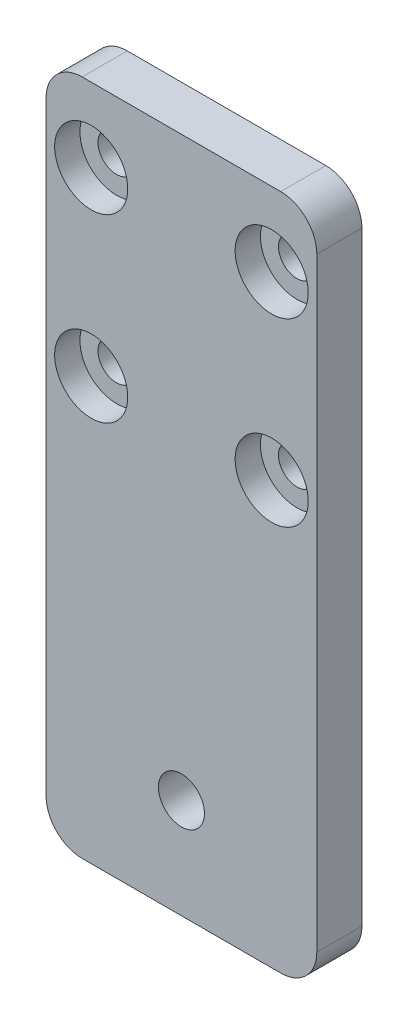
ISO-10303-21;
HEADER;
FILE_DESCRIPTION(('STEP AP214'),'2;1');
FILE_NAME('part.step','',(''),(''),'','','');
FILE_SCHEMA(('AUTOMOTIVE_DESIGN { 1 0 10303 214 1 1 1 1 }'));
ENDSEC;
DATA;
#1=APPLICATION_CONTEXT('core data for automotive mechanical design processes');
#2=APPLICATION_PROTOCOL_DEFINITION('international standard','automotive_design',2000,#1);
#3=PRODUCT_CONTEXT('',#1,'mechanical');
#4=PRODUCT('Part','Part','',(#3));
#5=PRODUCT_RELATED_PRODUCT_CATEGORY('part','',(#4));
#6=PRODUCT_DEFINITION_FORMATION('','',#4);
#7=PRODUCT_DEFINITION_CONTEXT('part definition',#1,'design');
#8=PRODUCT_DEFINITION('design','',#6,#7);
#9=PRODUCT_DEFINITION_SHAPE('','',#8);
#10=(LENGTH_UNIT() NAMED_UNIT(*) SI_UNIT(.MILLI.,.METRE.));
#11=(NAMED_UNIT(*) PLANE_ANGLE_UNIT() SI_UNIT($,.RADIAN.));
#12=(NAMED_UNIT(*) SI_UNIT($,.STERADIAN.) SOLID_ANGLE_UNIT());
#13=UNCERTAINTY_MEASURE_WITH_UNIT(LENGTH_MEASURE(1.E-05),#10,'distance_accuracy_value','');
#14=(GEOMETRIC_REPRESENTATION_CONTEXT(3) GLOBAL_UNCERTAINTY_ASSIGNED_CONTEXT((#13)) GLOBAL_UNIT_ASSIGNED_CONTEXT((#10,
#11,#12)) REPRESENTATION_CONTEXT('',''));
#15=CARTESIAN_POINT('',(0.,0.,0.));
#16=DIRECTION('',(0.,0.,1.));
#17=DIRECTION('',(1.,0.,0.));
#18=AXIS2_PLACEMENT_3D('',#15,#16,#17);
#19=CARTESIAN_POINT('',(25.,66.8,5.));
#20=DIRECTION('',(0.,0.,-1.));
#21=DIRECTION('',(-1.,0.,0.));
#22=AXIS2_PLACEMENT_3D('',#19,#20,#21);
#23=CYLINDRICAL_SURFACE('',#22,2.05);
#24=CARTESIAN_POINT('',(25.,66.8,0.));
#25=DIRECTION('',(0.,0.,1.));
#26=DIRECTION('',(1.,0.,0.));
#27=AXIS2_PLACEMENT_3D('',#24,#25,#26);
#28=CIRCLE('',#27,2.05);
#29=CARTESIAN_POINT('',(27.05,66.8,0.));
#30=VERTEX_POINT('',#29);
#31=EDGE_CURVE('E206',#30,#30,#28,.T.);
#32=ORIENTED_EDGE('',*,*,#31,.F.);
#33=EDGE_LOOP('',(#32));
#34=FACE_BOUND('',#33,.T.);
#35=CARTESIAN_POINT('',(25.,66.8,2.2));
#36=DIRECTION('',(0.,0.,1.));
#37=DIRECTION('',(1.,0.,0.));
#38=AXIS2_PLACEMENT_3D('',#35,#36,#37);
#39=CIRCLE('',#38,2.05);
#40=CARTESIAN_POINT('',(27.05,66.8,2.2));
#41=VERTEX_POINT('',#40);
#42=EDGE_CURVE('E36',#41,#41,#39,.T.);
#43=ORIENTED_EDGE('',*,*,#42,.T.);
#44=EDGE_LOOP('',(#43));
#45=FACE_BOUND('',#44,.T.);
#46=ADVANCED_FACE('F32',(#34,#45),#23,.F.);
#47=CARTESIAN_POINT('',(25.,46.8,5.));
#48=DIRECTION('',(0.,0.,-1.));
#49=DIRECTION('',(-1.,0.,0.));
#50=AXIS2_PLACEMENT_3D('',#47,#48,#49);
#51=CYLINDRICAL_SURFACE('',#50,2.05);
#52=CARTESIAN_POINT('',(25.,46.8,0.));
#53=DIRECTION('',(0.,0.,1.));
#54=DIRECTION('',(1.,0.,0.));
#55=AXIS2_PLACEMENT_3D('',#52,#53,#54);
#56=CIRCLE('',#55,2.05);
#57=CARTESIAN_POINT('',(27.05,46.8,0.));
#58=VERTEX_POINT('',#57);
#59=EDGE_CURVE('E203',#58,#58,#56,.T.);
#60=ORIENTED_EDGE('',*,*,#59,.F.);
#61=EDGE_LOOP('',(#60));
#62=FACE_BOUND('',#61,.T.);
#63=CARTESIAN_POINT('',(25.,46.8,2.2));
#64=DIRECTION('',(0.,0.,1.));
#65=DIRECTION('',(1.,0.,0.));
#66=AXIS2_PLACEMENT_3D('',#63,#64,#65);
#67=CIRCLE('',#66,2.05);
#68=CARTESIAN_POINT('',(27.05,46.8,2.2));
#69=VERTEX_POINT('',#68);
#70=EDGE_CURVE('E170',#69,#69,#67,.T.);
#71=ORIENTED_EDGE('',*,*,#70,.T.);
#72=EDGE_LOOP('',(#71));
#73=FACE_BOUND('',#72,.T.);
#74=ADVANCED_FACE('F245',(#62,#73),#51,.F.);
#75=CARTESIAN_POINT('',(5.,46.8,5.));
#76=DIRECTION('',(0.,0.,-1.));
#77=DIRECTION('',(-1.,0.,0.));
#78=AXIS2_PLACEMENT_3D('',#75,#76,#77);
#79=CYLINDRICAL_SURFACE('',#78,2.05000000000001);
#80=CARTESIAN_POINT('',(5.,46.8,0.));
#81=DIRECTION('',(0.,0.,1.));
#82=DIRECTION('',(1.,0.,0.));
#83=AXIS2_PLACEMENT_3D('',#80,#81,#82);
#84=CIRCLE('',#83,2.05000000000001);
#85=CARTESIAN_POINT('',(7.05,46.8,0.));
#86=VERTEX_POINT('',#85);
#87=EDGE_CURVE('E198',#86,#86,#84,.T.);
#88=ORIENTED_EDGE('',*,*,#87,.F.);
#89=EDGE_LOOP('',(#88));
#90=FACE_BOUND('',#89,.T.);
#91=CARTESIAN_POINT('',(5.,46.8,2.2));
#92=DIRECTION('',(0.,0.,1.));
#93=DIRECTION('',(1.,0.,0.));
#94=AXIS2_PLACEMENT_3D('',#91,#92,#93);
#95=CIRCLE('',#94,2.05000000000001);
#96=CARTESIAN_POINT('',(7.05,46.8,2.2));
#97=VERTEX_POINT('',#96);
#98=EDGE_CURVE('E166',#97,#97,#95,.T.);
#99=ORIENTED_EDGE('',*,*,#98,.T.);
#100=EDGE_LOOP('',(#99));
#101=FACE_BOUND('',#100,.T.);
#102=ADVANCED_FACE('F251',(#90,#101),#79,.F.);
#103=CARTESIAN_POINT('',(5.,66.8,5.));
#104=DIRECTION('',(0.,0.,-1.));
#105=DIRECTION('',(-1.,0.,0.));
#106=AXIS2_PLACEMENT_3D('',#103,#104,#105);
#107=CYLINDRICAL_SURFACE('',#106,2.04999999999999);
#108=CARTESIAN_POINT('',(5.,66.8,0.));
#109=DIRECTION('',(0.,0.,1.));
#110=DIRECTION('',(1.,0.,0.));
#111=AXIS2_PLACEMENT_3D('',#108,#109,#110);
#112=CIRCLE('',#111,2.04999999999999);
#113=CARTESIAN_POINT('',(7.04999999999999,66.8,0.));
#114=VERTEX_POINT('',#113);
#115=EDGE_CURVE('E132',#114,#114,#112,.T.);
#116=ORIENTED_EDGE('',*,*,#115,.F.);
#117=EDGE_LOOP('',(#116));
#118=FACE_BOUND('',#117,.T.);
#119=CARTESIAN_POINT('',(5.,66.8,2.2));
#120=DIRECTION('',(0.,0.,1.));
#121=DIRECTION('',(1.,0.,0.));
#122=AXIS2_PLACEMENT_3D('',#119,#120,#121);
#123=CIRCLE('',#122,2.04999999999999);
#124=CARTESIAN_POINT('',(7.04999999999999,66.8,2.2));
#125=VERTEX_POINT('',#124);
#126=EDGE_CURVE('E161',#125,#125,#123,.T.);
#127=ORIENTED_EDGE('',*,*,#126,.T.);
#128=EDGE_LOOP('',(#127));
#129=FACE_BOUND('',#128,.T.);
#130=ADVANCED_FACE('F258',(#118,#129),#107,.F.);
#131=CARTESIAN_POINT('',(0.,0.,5.));
#132=DIRECTION('',(0.,0.,1.));
#133=DIRECTION('',(1.,0.,0.));
#134=AXIS2_PLACEMENT_3D('',#131,#132,#133);
#135=PLANE('',#134);
#136=CARTESIAN_POINT('',(25.,66.8,5.));
#137=DIRECTION('',(0.,0.,1.));
#138=DIRECTION('',(1.,0.,0.));
#139=AXIS2_PLACEMENT_3D('',#136,#137,#138);
#140=CIRCLE('',#139,4.05);
#141=CARTESIAN_POINT('',(29.05,66.8,5.));
#142=VERTEX_POINT('',#141);
#143=EDGE_CURVE('E186',#142,#142,#140,.T.);
#144=ORIENTED_EDGE('',*,*,#143,.F.);
#145=EDGE_LOOP('',(#144));
#146=FACE_BOUND('',#145,.T.);
#147=CARTESIAN_POINT('',(25.,46.8,5.));
#148=DIRECTION('',(0.,0.,1.));
#149=DIRECTION('',(1.,0.,0.));
#150=AXIS2_PLACEMENT_3D('',#147,#148,#149);
#151=CIRCLE('',#150,4.05);
#152=CARTESIAN_POINT('',(29.05,46.8,5.));
#153=VERTEX_POINT('',#152);
#154=EDGE_CURVE('E179',#153,#153,#151,.T.);
#155=ORIENTED_EDGE('',*,*,#154,.F.);
#156=EDGE_LOOP('',(#155));
#157=FACE_BOUND('',#156,.T.);
#158=CARTESIAN_POINT('',(5.,46.8,5.));
#159=DIRECTION('',(0.,0.,1.));
#160=DIRECTION('',(1.,0.,0.));
#161=AXIS2_PLACEMENT_3D('',#158,#159,#160);
#162=CIRCLE('',#161,4.05);
#163=CARTESIAN_POINT('',(9.05,46.8,5.));
#164=VERTEX_POINT('',#163);
#165=EDGE_CURVE('E172',#164,#164,#162,.T.);
#166=ORIENTED_EDGE('',*,*,#165,.F.);
#167=EDGE_LOOP('',(#166));
#168=FACE_BOUND('',#167,.T.);
#169=CARTESIAN_POINT('',(5.,66.8,5.));
#170=DIRECTION('',(0.,0.,1.));
#171=DIRECTION('',(1.,0.,0.));
#172=AXIS2_PLACEMENT_3D('',#169,#170,#171);
#173=CIRCLE('',#172,4.05);
#174=CARTESIAN_POINT('',(9.05,66.8,5.));
#175=VERTEX_POINT('',#174);
#176=EDGE_CURVE('E168',#175,#175,#173,.T.);
#177=ORIENTED_EDGE('',*,*,#176,.F.);
#178=EDGE_LOOP('',(#177));
#179=FACE_BOUND('',#178,.T.);
#180=DIRECTION('',(0.,-1.,0.));
#181=VECTOR('',#180,1.);
#182=CARTESIAN_POINT('',(0.,75.,5.));
#183=LINE('',#182,#181);
#184=CARTESIAN_POINT('',(0.,71.,5.));
#185=VERTEX_POINT('',#184);
#186=CARTESIAN_POINT('',(0.,4.,5.));
#187=VERTEX_POINT('',#186);
#188=EDGE_CURVE('E137',#185,#187,#183,.T.);
#189=ORIENTED_EDGE('',*,*,#188,.T.);
#190=CARTESIAN_POINT('',(4.,4.,5.));
#191=DIRECTION('',(0.,0.,1.));
#192=DIRECTION('',(1.,0.,0.));
#193=AXIS2_PLACEMENT_3D('',#190,#191,#192);
#194=CIRCLE('',#193,4.);
#195=CARTESIAN_POINT('',(4.,0.,5.));
#196=VERTEX_POINT('',#195);
#197=EDGE_CURVE('E152',#187,#196,#194,.T.);
#198=ORIENTED_EDGE('',*,*,#197,.T.);
#199=DIRECTION('',(1.,0.,0.));
#200=VECTOR('',#199,1.);
#201=CARTESIAN_POINT('',(0.,0.,5.));
#202=LINE('',#201,#200);
#203=CARTESIAN_POINT('',(26.,0.,5.));
#204=VERTEX_POINT('',#203);
#205=EDGE_CURVE('E119',#196,#204,#202,.T.);
#206=ORIENTED_EDGE('',*,*,#205,.T.);
#207=CARTESIAN_POINT('',(26.,4.,5.));
#208=DIRECTION('',(0.,0.,1.));
#209=DIRECTION('',(1.,0.,0.));
#210=AXIS2_PLACEMENT_3D('',#207,#208,#209);
#211=CIRCLE('',#210,4.);
#212=CARTESIAN_POINT('',(30.,4.,5.));
#213=VERTEX_POINT('',#212);
#214=EDGE_CURVE('E150',#204,#213,#211,.T.);
#215=ORIENTED_EDGE('',*,*,#214,.T.);
#216=DIRECTION('',(0.,1.,0.));
#217=VECTOR('',#216,1.);
#218=CARTESIAN_POINT('',(30.,75.,5.));
#219=LINE('',#218,#217);
#220=CARTESIAN_POINT('',(30.,71.,5.));
#221=VERTEX_POINT('',#220);
#222=EDGE_CURVE('E214',#213,#221,#219,.T.);
#223=ORIENTED_EDGE('',*,*,#222,.T.);
#224=CARTESIAN_POINT('',(26.,71.,5.));
#225=DIRECTION('',(0.,0.,1.));
#226=DIRECTION('',(1.,0.,0.));
#227=AXIS2_PLACEMENT_3D('',#224,#225,#226);
#228=CIRCLE('',#227,4.);
#229=CARTESIAN_POINT('',(26.,75.,5.));
#230=VERTEX_POINT('',#229);
#231=EDGE_CURVE('E54',#221,#230,#228,.T.);
#232=ORIENTED_EDGE('',*,*,#231,.T.);
#233=DIRECTION('',(-1.,0.,0.));
#234=VECTOR('',#233,1.);
#235=CARTESIAN_POINT('',(0.,75.,5.));
#236=LINE('',#235,#234);
#237=CARTESIAN_POINT('',(4.,75.,5.));
#238=VERTEX_POINT('',#237);
#239=EDGE_CURVE('E138',#230,#238,#236,.T.);
#240=ORIENTED_EDGE('',*,*,#239,.T.);
#241=CARTESIAN_POINT('',(4.,71.,5.));
#242=DIRECTION('',(0.,0.,1.));
#243=DIRECTION('',(1.,0.,0.));
#244=AXIS2_PLACEMENT_3D('',#241,#242,#243);
#245=CIRCLE('',#244,4.);
#246=EDGE_CURVE('E148',#238,#185,#245,.T.);
#247=ORIENTED_EDGE('',*,*,#246,.T.);
#248=EDGE_LOOP('',(#189,#198,#206,#215,#223,#232,#240,#247));
#249=FACE_BOUND('',#248,.T.);
#250=CARTESIAN_POINT('',(15.,11.08,5.));
#251=DIRECTION('',(0.,0.,1.));
#252=DIRECTION('',(1.,0.,0.));
#253=AXIS2_PLACEMENT_3D('',#250,#251,#252);
#254=CIRCLE('',#253,2.54999999999999);
#255=CARTESIAN_POINT('',(17.55,11.08,5.));
#256=VERTEX_POINT('',#255);
#257=EDGE_CURVE('E195',#256,#256,#254,.T.);
#258=ORIENTED_EDGE('',*,*,#257,.F.);
#259=EDGE_LOOP('',(#258));
#260=FACE_BOUND('',#259,.T.);
#261=ADVANCED_FACE('F216',(#146,#157,#168,#179,#249,#260),#135,.T.);
#262=CARTESIAN_POINT('',(0.,0.,0.));
#263=DIRECTION('',(0.,0.,1.));
#264=DIRECTION('',(1.,0.,0.));
#265=AXIS2_PLACEMENT_3D('',#262,#263,#264);
#266=PLANE('',#265);
#267=DIRECTION('',(1.,0.,0.));
#268=VECTOR('',#267,1.);
#269=CARTESIAN_POINT('',(0.,0.,0.));
#270=LINE('',#269,#268);
#271=CARTESIAN_POINT('',(4.,0.,0.));
#272=VERTEX_POINT('',#271);
#273=CARTESIAN_POINT('',(26.,0.,0.));
#274=VERTEX_POINT('',#273);
#275=EDGE_CURVE('E116',#272,#274,#270,.T.);
#276=ORIENTED_EDGE('',*,*,#275,.F.);
#277=CARTESIAN_POINT('',(4.,4.,0.));
#278=DIRECTION('',(0.,0.,1.));
#279=DIRECTION('',(1.,0.,0.));
#280=AXIS2_PLACEMENT_3D('',#277,#278,#279);
#281=CIRCLE('',#280,4.);
#282=CARTESIAN_POINT('',(0.,4.,0.));
#283=VERTEX_POINT('',#282);
#284=EDGE_CURVE('E99',#272,#283,#281,.F.);
#285=ORIENTED_EDGE('',*,*,#284,.T.);
#286=DIRECTION('',(0.,-1.,0.));
#287=VECTOR('',#286,1.);
#288=CARTESIAN_POINT('',(0.,75.,0.));
#289=LINE('',#288,#287);
#290=CARTESIAN_POINT('',(0.,71.,0.));
#291=VERTEX_POINT('',#290);
#292=EDGE_CURVE('E127',#291,#283,#289,.T.);
#293=ORIENTED_EDGE('',*,*,#292,.F.);
#294=CARTESIAN_POINT('',(4.,71.,0.));
#295=DIRECTION('',(0.,0.,1.));
#296=DIRECTION('',(1.,0.,0.));
#297=AXIS2_PLACEMENT_3D('',#294,#295,#296);
#298=CIRCLE('',#297,4.);
#299=CARTESIAN_POINT('',(4.,75.,0.));
#300=VERTEX_POINT('',#299);
#301=EDGE_CURVE('E141',#291,#300,#298,.F.);
#302=ORIENTED_EDGE('',*,*,#301,.T.);
#303=DIRECTION('',(-1.,0.,0.));
#304=VECTOR('',#303,1.);
#305=CARTESIAN_POINT('',(0.,75.,0.));
#306=LINE('',#305,#304);
#307=CARTESIAN_POINT('',(26.,75.,0.));
#308=VERTEX_POINT('',#307);
#309=EDGE_CURVE('E130',#308,#300,#306,.T.);
#310=ORIENTED_EDGE('',*,*,#309,.F.);
#311=CARTESIAN_POINT('',(26.,71.,0.));
#312=DIRECTION('',(0.,0.,1.));
#313=DIRECTION('',(1.,0.,0.));
#314=AXIS2_PLACEMENT_3D('',#311,#312,#313);
#315=CIRCLE('',#314,4.);
#316=CARTESIAN_POINT('',(30.,71.,0.));
#317=VERTEX_POINT('',#316);
#318=EDGE_CURVE('E120',#308,#317,#315,.F.);
#319=ORIENTED_EDGE('',*,*,#318,.T.);
#320=DIRECTION('',(0.,1.,0.));
#321=VECTOR('',#320,1.);
#322=CARTESIAN_POINT('',(30.,75.,0.));
#323=LINE('',#322,#321);
#324=CARTESIAN_POINT('',(30.,4.,0.));
#325=VERTEX_POINT('',#324);
#326=EDGE_CURVE('E126',#325,#317,#323,.T.);
#327=ORIENTED_EDGE('',*,*,#326,.F.);
#328=CARTESIAN_POINT('',(26.,4.,0.));
#329=DIRECTION('',(0.,0.,1.));
#330=DIRECTION('',(1.,0.,0.));
#331=AXIS2_PLACEMENT_3D('',#328,#329,#330);
#332=CIRCLE('',#331,4.);
#333=EDGE_CURVE('E110',#325,#274,#332,.F.);
#334=ORIENTED_EDGE('',*,*,#333,.T.);
#335=EDGE_LOOP('',(#276,#285,#293,#302,#310,#319,#327,#334));
#336=FACE_BOUND('',#335,.T.);
#337=ORIENTED_EDGE('',*,*,#115,.T.);
#338=EDGE_LOOP('',(#337));
#339=FACE_BOUND('',#338,.T.);
#340=ORIENTED_EDGE('',*,*,#31,.T.);
#341=EDGE_LOOP('',(#340));
#342=FACE_BOUND('',#341,.T.);
#343=ORIENTED_EDGE('',*,*,#59,.T.);
#344=EDGE_LOOP('',(#343));
#345=FACE_BOUND('',#344,.T.);
#346=ORIENTED_EDGE('',*,*,#87,.T.);
#347=EDGE_LOOP('',(#346));
#348=FACE_BOUND('',#347,.T.);
#349=CARTESIAN_POINT('',(15.,11.08,0.));
#350=DIRECTION('',(0.,0.,1.));
#351=DIRECTION('',(1.,0.,0.));
#352=AXIS2_PLACEMENT_3D('',#349,#350,#351);
#353=CIRCLE('',#352,2.54999999999999);
#354=CARTESIAN_POINT('',(17.55,11.08,0.));
#355=VERTEX_POINT('',#354);
#356=EDGE_CURVE('E164',#355,#355,#353,.T.);
#357=ORIENTED_EDGE('',*,*,#356,.T.);
#358=EDGE_LOOP('',(#357));
#359=FACE_BOUND('',#358,.T.);
#360=ADVANCED_FACE('F123',(#336,#339,#342,#345,#348,#359),#266,.F.);
#361=CARTESIAN_POINT('',(0.,75.,5.));
#362=DIRECTION('',(1.,0.,0.));
#363=DIRECTION('',(0.,1.,0.));
#364=AXIS2_PLACEMENT_3D('',#361,#362,#363);
#365=PLANE('',#364);
#366=ORIENTED_EDGE('',*,*,#292,.T.);
#367=DIRECTION('',(0.,0.,-1.));
#368=VECTOR('',#367,1.);
#369=CARTESIAN_POINT('',(0.,4.,5.));
#370=LINE('',#369,#368);
#371=EDGE_CURVE('E104',#283,#187,#370,.F.);
#372=ORIENTED_EDGE('',*,*,#371,.T.);
#373=ORIENTED_EDGE('',*,*,#188,.F.);
#374=DIRECTION('',(0.,0.,-1.));
#375=VECTOR('',#374,1.);
#376=CARTESIAN_POINT('',(0.,71.,5.));
#377=LINE('',#376,#375);
#378=EDGE_CURVE('E109',#185,#291,#377,.T.);
#379=ORIENTED_EDGE('',*,*,#378,.T.);
#380=EDGE_LOOP('',(#366,#372,#373,#379));
#381=FACE_BOUND('',#380,.T.);
#382=ADVANCED_FACE('F224',(#381),#365,.F.);
#383=CARTESIAN_POINT('',(0.,0.,5.));
#384=DIRECTION('',(0.,1.,0.));
#385=DIRECTION('',(-1.,0.,0.));
#386=AXIS2_PLACEMENT_3D('',#383,#384,#385);
#387=PLANE('',#386);
#388=ORIENTED_EDGE('',*,*,#205,.F.);
#389=DIRECTION('',(0.,0.,-1.));
#390=VECTOR('',#389,1.);
#391=CARTESIAN_POINT('',(4.,0.,5.));
#392=LINE('',#391,#390);
#393=EDGE_CURVE('E103',#196,#272,#392,.T.);
#394=ORIENTED_EDGE('',*,*,#393,.T.);
#395=ORIENTED_EDGE('',*,*,#275,.T.);
#396=DIRECTION('',(0.,0.,-1.));
#397=VECTOR('',#396,1.);
#398=CARTESIAN_POINT('',(26.,0.,5.));
#399=LINE('',#398,#397);
#400=EDGE_CURVE('E121',#274,#204,#399,.F.);
#401=ORIENTED_EDGE('',*,*,#400,.T.);
#402=EDGE_LOOP('',(#388,#394,#395,#401));
#403=FACE_BOUND('',#402,.T.);
#404=ADVANCED_FACE('F115',(#403),#387,.F.);
#405=CARTESIAN_POINT('',(30.,75.,5.));
#406=DIRECTION('',(-1.,0.,0.));
#407=DIRECTION('',(0.,-1.,0.));
#408=AXIS2_PLACEMENT_3D('',#405,#406,#407);
#409=PLANE('',#408);
#410=ORIENTED_EDGE('',*,*,#222,.F.);
#411=DIRECTION('',(0.,0.,-1.));
#412=VECTOR('',#411,1.);
#413=CARTESIAN_POINT('',(30.,4.,5.));
#414=LINE('',#413,#412);
#415=EDGE_CURVE('E156',#213,#325,#414,.T.);
#416=ORIENTED_EDGE('',*,*,#415,.T.);
#417=ORIENTED_EDGE('',*,*,#326,.T.);
#418=DIRECTION('',(0.,0.,-1.));
#419=VECTOR('',#418,1.);
#420=CARTESIAN_POINT('',(30.,71.,5.));
#421=LINE('',#420,#419);
#422=EDGE_CURVE('E154',#317,#221,#421,.F.);
#423=ORIENTED_EDGE('',*,*,#422,.T.);
#424=EDGE_LOOP('',(#410,#416,#417,#423));
#425=FACE_BOUND('',#424,.T.);
#426=ADVANCED_FACE('F231',(#425),#409,.F.);
#427=CARTESIAN_POINT('',(0.,75.,5.));
#428=DIRECTION('',(0.,-1.,0.));
#429=DIRECTION('',(0.,0.,-1.));
#430=AXIS2_PLACEMENT_3D('',#427,#428,#429);
#431=PLANE('',#430);
#432=ORIENTED_EDGE('',*,*,#309,.T.);
#433=DIRECTION('',(0.,0.,-1.));
#434=VECTOR('',#433,1.);
#435=CARTESIAN_POINT('',(4.,75.,5.));
#436=LINE('',#435,#434);
#437=EDGE_CURVE('E11',#300,#238,#436,.F.);
#438=ORIENTED_EDGE('',*,*,#437,.T.);
#439=ORIENTED_EDGE('',*,*,#239,.F.);
#440=DIRECTION('',(0.,0.,-1.));
#441=VECTOR('',#440,1.);
#442=CARTESIAN_POINT('',(26.,75.,5.));
#443=LINE('',#442,#441);
#444=EDGE_CURVE('E41',#230,#308,#443,.T.);
#445=ORIENTED_EDGE('',*,*,#444,.T.);
#446=EDGE_LOOP('',(#432,#438,#439,#445));
#447=FACE_BOUND('',#446,.T.);
#448=ADVANCED_FACE('F226',(#447),#431,.F.);
#449=CARTESIAN_POINT('',(15.,11.08,5.));
#450=DIRECTION('',(0.,0.,-1.));
#451=DIRECTION('',(-1.,0.,0.));
#452=AXIS2_PLACEMENT_3D('',#449,#450,#451);
#453=CYLINDRICAL_SURFACE('',#452,2.54999999999999);
#454=ORIENTED_EDGE('',*,*,#257,.T.);
#455=EDGE_LOOP('',(#454));
#456=FACE_BOUND('',#455,.T.);
#457=ORIENTED_EDGE('',*,*,#356,.F.);
#458=EDGE_LOOP('',(#457));
#459=FACE_BOUND('',#458,.T.);
#460=ADVANCED_FACE('F242',(#456,#459),#453,.F.);
#461=CARTESIAN_POINT('',(4.,4.,5.));
#462=DIRECTION('',(0.,0.,-1.));
#463=DIRECTION('',(-1.,0.,0.));
#464=AXIS2_PLACEMENT_3D('',#461,#462,#463);
#465=CYLINDRICAL_SURFACE('',#464,4.);
#466=ORIENTED_EDGE('',*,*,#197,.F.);
#467=ORIENTED_EDGE('',*,*,#371,.F.);
#468=ORIENTED_EDGE('',*,*,#284,.F.);
#469=ORIENTED_EDGE('',*,*,#393,.F.);
#470=EDGE_LOOP('',(#466,#467,#468,#469));
#471=FACE_BOUND('',#470,.T.);
#472=ADVANCED_FACE('F102',(#471),#465,.T.);
#473=CARTESIAN_POINT('',(26.,4.,5.));
#474=DIRECTION('',(0.,0.,-1.));
#475=DIRECTION('',(-1.,0.,0.));
#476=AXIS2_PLACEMENT_3D('',#473,#474,#475);
#477=CYLINDRICAL_SURFACE('',#476,4.);
#478=ORIENTED_EDGE('',*,*,#214,.F.);
#479=ORIENTED_EDGE('',*,*,#400,.F.);
#480=ORIENTED_EDGE('',*,*,#333,.F.);
#481=ORIENTED_EDGE('',*,*,#415,.F.);
#482=EDGE_LOOP('',(#478,#479,#480,#481));
#483=FACE_BOUND('',#482,.T.);
#484=ADVANCED_FACE('F235',(#483),#477,.T.);
#485=CARTESIAN_POINT('',(4.,71.,5.));
#486=DIRECTION('',(0.,0.,-1.));
#487=DIRECTION('',(-1.,0.,0.));
#488=AXIS2_PLACEMENT_3D('',#485,#486,#487);
#489=CYLINDRICAL_SURFACE('',#488,4.);
#490=ORIENTED_EDGE('',*,*,#246,.F.);
#491=ORIENTED_EDGE('',*,*,#437,.F.);
#492=ORIENTED_EDGE('',*,*,#301,.F.);
#493=ORIENTED_EDGE('',*,*,#378,.F.);
#494=EDGE_LOOP('',(#490,#491,#492,#493));
#495=FACE_BOUND('',#494,.T.);
#496=ADVANCED_FACE('F222',(#495),#489,.T.);
#497=CARTESIAN_POINT('',(26.,71.,5.));
#498=DIRECTION('',(0.,0.,-1.));
#499=DIRECTION('',(-1.,0.,0.));
#500=AXIS2_PLACEMENT_3D('',#497,#498,#499);
#501=CYLINDRICAL_SURFACE('',#500,4.);
#502=ORIENTED_EDGE('',*,*,#231,.F.);
#503=ORIENTED_EDGE('',*,*,#422,.F.);
#504=ORIENTED_EDGE('',*,*,#318,.F.);
#505=ORIENTED_EDGE('',*,*,#444,.F.);
#506=EDGE_LOOP('',(#502,#503,#504,#505));
#507=FACE_BOUND('',#506,.T.);
#508=ADVANCED_FACE('F34',(#507),#501,.T.);
#509=CARTESIAN_POINT('',(5.,66.8,2.2));
#510=DIRECTION('',(0.,0.,1.));
#511=DIRECTION('',(1.,0.,0.));
#512=AXIS2_PLACEMENT_3D('',#509,#510,#511);
#513=CYLINDRICAL_SURFACE('',#512,4.05);
#514=CARTESIAN_POINT('',(5.,66.8,2.2));
#515=DIRECTION('',(0.,0.,1.));
#516=DIRECTION('',(1.,0.,0.));
#517=AXIS2_PLACEMENT_3D('',#514,#515,#516);
#518=CIRCLE('',#517,4.05);
#519=CARTESIAN_POINT('',(9.05,66.8,2.2));
#520=VERTEX_POINT('',#519);
#521=EDGE_CURVE('E165',#520,#520,#518,.T.);
#522=ORIENTED_EDGE('',*,*,#521,.F.);
#523=EDGE_LOOP('',(#522));
#524=FACE_BOUND('',#523,.T.);
#525=ORIENTED_EDGE('',*,*,#176,.T.);
#526=EDGE_LOOP('',(#525));
#527=FACE_BOUND('',#526,.T.);
#528=ADVANCED_FACE('F319',(#524,#527),#513,.F.);
#529=CARTESIAN_POINT('',(5.,66.8,2.2));
#530=DIRECTION('',(0.,0.,1.));
#531=DIRECTION('',(1.,0.,0.));
#532=AXIS2_PLACEMENT_3D('',#529,#530,#531);
#533=PLANE('',#532);
#534=ORIENTED_EDGE('',*,*,#126,.F.);
#535=EDGE_LOOP('',(#534));
#536=FACE_BOUND('',#535,.T.);
#537=ORIENTED_EDGE('',*,*,#521,.T.);
#538=EDGE_LOOP('',(#537));
#539=FACE_BOUND('',#538,.T.);
#540=ADVANCED_FACE('F359',(#536,#539),#533,.T.);
#541=CARTESIAN_POINT('',(5.,46.8,2.2));
#542=DIRECTION('',(0.,0.,1.));
#543=DIRECTION('',(1.,0.,0.));
#544=AXIS2_PLACEMENT_3D('',#541,#542,#543);
#545=CYLINDRICAL_SURFACE('',#544,4.05);
#546=CARTESIAN_POINT('',(5.,46.8,2.2));
#547=DIRECTION('',(0.,0.,1.));
#548=DIRECTION('',(1.,0.,0.));
#549=AXIS2_PLACEMENT_3D('',#546,#547,#548);
#550=CIRCLE('',#549,4.05);
#551=CARTESIAN_POINT('',(9.05,46.8,2.2));
#552=VERTEX_POINT('',#551);
#553=EDGE_CURVE('E169',#552,#552,#550,.T.);
#554=ORIENTED_EDGE('',*,*,#553,.F.);
#555=EDGE_LOOP('',(#554));
#556=FACE_BOUND('',#555,.T.);
#557=ORIENTED_EDGE('',*,*,#165,.T.);
#558=EDGE_LOOP('',(#557));
#559=FACE_BOUND('',#558,.T.);
#560=ADVANCED_FACE('F369',(#556,#559),#545,.F.);
#561=CARTESIAN_POINT('',(5.,46.8,2.2));
#562=DIRECTION('',(0.,0.,1.));
#563=DIRECTION('',(1.,0.,0.));
#564=AXIS2_PLACEMENT_3D('',#561,#562,#563);
#565=PLANE('',#564);
#566=ORIENTED_EDGE('',*,*,#98,.F.);
#567=EDGE_LOOP('',(#566));
#568=FACE_BOUND('',#567,.T.);
#569=ORIENTED_EDGE('',*,*,#553,.T.);
#570=EDGE_LOOP('',(#569));
#571=FACE_BOUND('',#570,.T.);
#572=ADVANCED_FACE('F379',(#568,#571),#565,.T.);
#573=CARTESIAN_POINT('',(25.,46.8,2.2));
#574=DIRECTION('',(0.,0.,1.));
#575=DIRECTION('',(1.,0.,0.));
#576=AXIS2_PLACEMENT_3D('',#573,#574,#575);
#577=CYLINDRICAL_SURFACE('',#576,4.05);
#578=CARTESIAN_POINT('',(25.,46.8,2.2));
#579=DIRECTION('',(0.,0.,1.));
#580=DIRECTION('',(1.,0.,0.));
#581=AXIS2_PLACEMENT_3D('',#578,#579,#580);
#582=CIRCLE('',#581,4.05);
#583=CARTESIAN_POINT('',(29.05,46.8,2.2));
#584=VERTEX_POINT('',#583);
#585=EDGE_CURVE('E173',#584,#584,#582,.T.);
#586=ORIENTED_EDGE('',*,*,#585,.F.);
#587=EDGE_LOOP('',(#586));
#588=FACE_BOUND('',#587,.T.);
#589=ORIENTED_EDGE('',*,*,#154,.T.);
#590=EDGE_LOOP('',(#589));
#591=FACE_BOUND('',#590,.T.);
#592=ADVANCED_FACE('F389',(#588,#591),#577,.F.);
#593=CARTESIAN_POINT('',(25.,46.8,2.2));
#594=DIRECTION('',(0.,0.,1.));
#595=DIRECTION('',(1.,0.,0.));
#596=AXIS2_PLACEMENT_3D('',#593,#594,#595);
#597=PLANE('',#596);
#598=ORIENTED_EDGE('',*,*,#70,.F.);
#599=EDGE_LOOP('',(#598));
#600=FACE_BOUND('',#599,.T.);
#601=ORIENTED_EDGE('',*,*,#585,.T.);
#602=EDGE_LOOP('',(#601));
#603=FACE_BOUND('',#602,.T.);
#604=ADVANCED_FACE('F399',(#600,#603),#597,.T.);
#605=CARTESIAN_POINT('',(25.,66.8,2.2));
#606=DIRECTION('',(0.,0.,1.));
#607=DIRECTION('',(1.,0.,0.));
#608=AXIS2_PLACEMENT_3D('',#605,#606,#607);
#609=CYLINDRICAL_SURFACE('',#608,4.05);
#610=CARTESIAN_POINT('',(25.,66.8,2.2));
#611=DIRECTION('',(0.,0.,1.));
#612=DIRECTION('',(1.,0.,0.));
#613=AXIS2_PLACEMENT_3D('',#610,#611,#612);
#614=CIRCLE('',#613,4.05);
#615=CARTESIAN_POINT('',(29.05,66.8,2.2));
#616=VERTEX_POINT('',#615);
#617=EDGE_CURVE('E438',#616,#616,#614,.T.);
#618=ORIENTED_EDGE('',*,*,#617,.F.);
#619=EDGE_LOOP('',(#618));
#620=FACE_BOUND('',#619,.T.);
#621=ORIENTED_EDGE('',*,*,#143,.T.);
#622=EDGE_LOOP('',(#621));
#623=FACE_BOUND('',#622,.T.);
#624=ADVANCED_FACE('F409',(#620,#623),#609,.F.);
#625=CARTESIAN_POINT('',(25.,66.8,2.2));
#626=DIRECTION('',(0.,0.,1.));
#627=DIRECTION('',(1.,0.,0.));
#628=AXIS2_PLACEMENT_3D('',#625,#626,#627);
#629=PLANE('',#628);
#630=ORIENTED_EDGE('',*,*,#42,.F.);
#631=EDGE_LOOP('',(#630));
#632=FACE_BOUND('',#631,.T.);
#633=ORIENTED_EDGE('',*,*,#617,.T.);
#634=EDGE_LOOP('',(#633));
#635=FACE_BOUND('',#634,.T.);
#636=ADVANCED_FACE('F419',(#632,#635),#629,.T.);
#637=CLOSED_SHELL('',(#46,#74,#102,#130,#261,#360,#382,#404,#426,#448,#460,#472,#484,#496,#508,
#528,#540,#560,#572,#592,#604,#624,#636));
#638=MANIFOLD_SOLID_BREP('B2',#637);
#639=ADVANCED_BREP_SHAPE_REPRESENTATION('',(#18,#638),#14);
#640=SHAPE_DEFINITION_REPRESENTATION(#9,#639);
ENDSEC;
END-ISO-10303-21;
